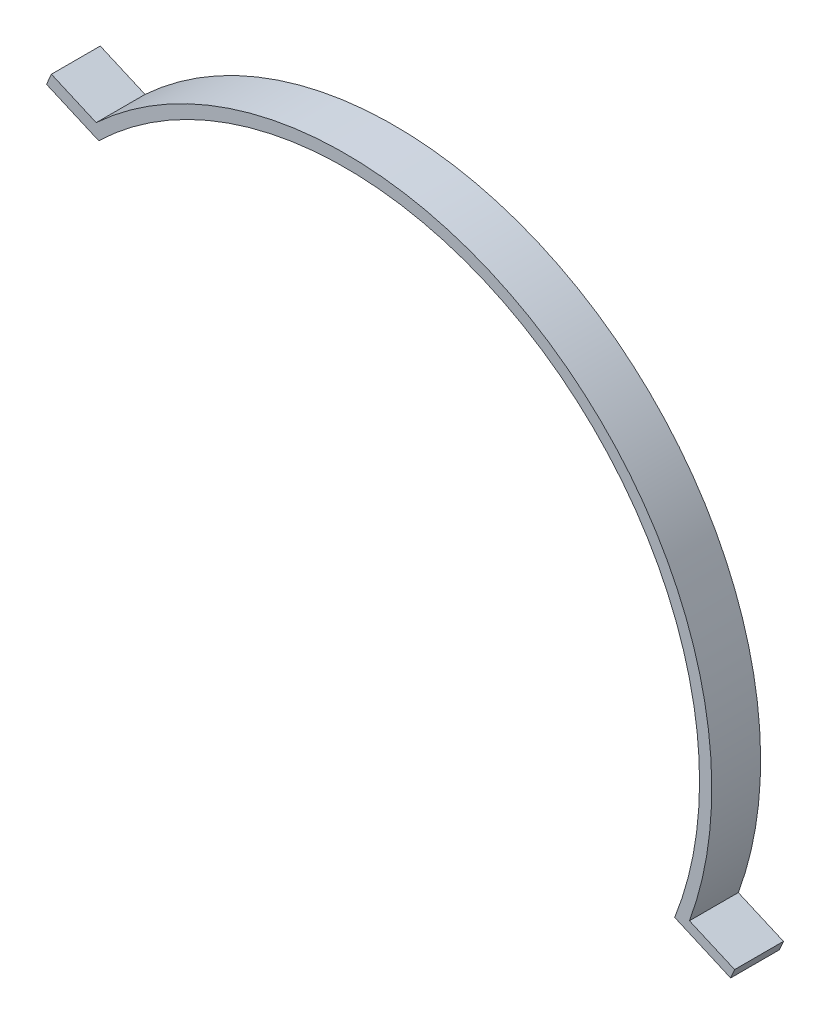
ISO-10303-21;
HEADER;
FILE_DESCRIPTION(('STEP AP214'),'2;1');
FILE_NAME('part.step','',(''),(''),'','','');
FILE_SCHEMA(('AUTOMOTIVE_DESIGN { 1 0 10303 214 1 1 1 1 }'));
ENDSEC;
DATA;
#1=APPLICATION_CONTEXT('core data for automotive mechanical design processes');
#2=APPLICATION_PROTOCOL_DEFINITION('international standard','automotive_design',2000,#1);
#3=PRODUCT_CONTEXT('',#1,'mechanical');
#4=PRODUCT('Part','Part','',(#3));
#5=PRODUCT_RELATED_PRODUCT_CATEGORY('part','',(#4));
#6=PRODUCT_DEFINITION_FORMATION('','',#4);
#7=PRODUCT_DEFINITION_CONTEXT('part definition',#1,'design');
#8=PRODUCT_DEFINITION('design','',#6,#7);
#9=PRODUCT_DEFINITION_SHAPE('','',#8);
#10=(LENGTH_UNIT() NAMED_UNIT(*) SI_UNIT(.MILLI.,.METRE.));
#11=(NAMED_UNIT(*) PLANE_ANGLE_UNIT() SI_UNIT($,.RADIAN.));
#12=(NAMED_UNIT(*) SI_UNIT($,.STERADIAN.) SOLID_ANGLE_UNIT());
#13=UNCERTAINTY_MEASURE_WITH_UNIT(LENGTH_MEASURE(1.E-05),#10,'distance_accuracy_value','');
#14=(GEOMETRIC_REPRESENTATION_CONTEXT(3) GLOBAL_UNCERTAINTY_ASSIGNED_CONTEXT((#13)) GLOBAL_UNIT_ASSIGNED_CONTEXT((#10,
#11,#12)) REPRESENTATION_CONTEXT('',''));
#15=CARTESIAN_POINT('',(0.,0.,0.));
#16=DIRECTION('',(0.,0.,1.));
#17=DIRECTION('',(1.,0.,0.));
#18=AXIS2_PLACEMENT_3D('',#15,#16,#17);
#19=CARTESIAN_POINT('',(0.,0.,20.));
#20=DIRECTION('',(0.,0.,-1.));
#21=DIRECTION('',(-1.,0.,0.));
#22=AXIS2_PLACEMENT_3D('',#19,#20,#21);
#23=CYLINDRICAL_SURFACE('',#22,150.);
#24=CARTESIAN_POINT('',(0.,0.,0.));
#25=DIRECTION('',(0.,0.,1.));
#26=DIRECTION('',(1.,0.,0.));
#27=AXIS2_PLACEMENT_3D('',#24,#25,#26);
#28=CIRCLE('',#27,150.);
#29=CARTESIAN_POINT('',(140.862056563505,-51.5546411169736,0.));
#30=VERTEX_POINT('',#29);
#31=CARTESIAN_POINT('',(-102.,109.98181667894,0.));
#32=VERTEX_POINT('',#31);
#33=EDGE_CURVE('E145',#30,#32,#28,.T.);
#34=ORIENTED_EDGE('',*,*,#33,.T.);
#35=DIRECTION('',(0.,0.,-1.));
#36=VECTOR('',#35,1.);
#37=CARTESIAN_POINT('',(-102.,109.98181667894,20.));
#38=LINE('',#37,#36);
#39=CARTESIAN_POINT('',(-102.,109.98181667894,20.));
#40=VERTEX_POINT('',#39);
#41=EDGE_CURVE('E11',#40,#32,#38,.T.);
#42=ORIENTED_EDGE('',*,*,#41,.F.);
#43=CARTESIAN_POINT('',(0.,0.,20.));
#44=DIRECTION('',(0.,0.,1.));
#45=DIRECTION('',(1.,0.,0.));
#46=AXIS2_PLACEMENT_3D('',#43,#44,#45);
#47=CIRCLE('',#46,150.);
#48=CARTESIAN_POINT('',(140.862056563505,-51.5546411169736,20.));
#49=VERTEX_POINT('',#48);
#50=EDGE_CURVE('E163',#49,#40,#47,.T.);
#51=ORIENTED_EDGE('',*,*,#50,.F.);
#52=DIRECTION('',(0.,0.,-1.));
#53=VECTOR('',#52,1.);
#54=CARTESIAN_POINT('',(140.862056563505,-51.5546411169736,20.));
#55=LINE('',#54,#53);
#56=EDGE_CURVE('E141',#49,#30,#55,.T.);
#57=ORIENTED_EDGE('',*,*,#56,.T.);
#58=EDGE_LOOP('',(#34,#42,#51,#57));
#59=FACE_BOUND('',#58,.T.);
#60=ADVANCED_FACE('F37',(#59),#23,.T.);
#61=CARTESIAN_POINT('',(-102.,109.98181667894,20.));
#62=DIRECTION('',(-0.4,-0.916515138991168,0.));
#63=DIRECTION('',(0.916515138991168,-0.400000000000001,0.));
#64=AXIS2_PLACEMENT_3D('',#61,#62,#63);
#65=PLANE('',#64);
#66=DIRECTION('',(-0.916515138991168,0.4,0.));
#67=VECTOR('',#66,1.);
#68=CARTESIAN_POINT('',(-102.,109.98181667894,0.));
#69=LINE('',#68,#67);
#70=CARTESIAN_POINT('',(-120.330302779823,117.98181667894,0.));
#71=VERTEX_POINT('',#70);
#72=EDGE_CURVE('E148',#32,#71,#69,.T.);
#73=ORIENTED_EDGE('',*,*,#72,.T.);
#74=DIRECTION('',(0.,0.,-1.));
#75=VECTOR('',#74,1.);
#76=CARTESIAN_POINT('',(-120.330302779823,117.98181667894,20.));
#77=LINE('',#76,#75);
#78=CARTESIAN_POINT('',(-120.330302779823,117.98181667894,20.));
#79=VERTEX_POINT('',#78);
#80=EDGE_CURVE('E45',#79,#71,#77,.T.);
#81=ORIENTED_EDGE('',*,*,#80,.F.);
#82=DIRECTION('',(-0.916515138991168,0.4,0.));
#83=VECTOR('',#82,1.);
#84=CARTESIAN_POINT('',(-102.,109.98181667894,20.));
#85=LINE('',#84,#83);
#86=EDGE_CURVE('E102',#40,#79,#85,.T.);
#87=ORIENTED_EDGE('',*,*,#86,.F.);
#88=ORIENTED_EDGE('',*,*,#41,.T.);
#89=EDGE_LOOP('',(#73,#81,#87,#88));
#90=FACE_BOUND('',#89,.T.);
#91=ADVANCED_FACE('F212',(#90),#65,.F.);
#92=CARTESIAN_POINT('',(-120.330302779823,117.98181667894,20.));
#93=DIRECTION('',(0.916515138991168,-0.400000000000001,0.));
#94=DIRECTION('',(0.400000000000001,0.916515138991168,0.));
#95=AXIS2_PLACEMENT_3D('',#92,#93,#94);
#96=PLANE('',#95);
#97=DIRECTION('',(-0.400000000000001,-0.916515138991168,0.));
#98=VECTOR('',#97,1.);
#99=CARTESIAN_POINT('',(-120.330302779823,117.98181667894,0.));
#100=LINE('',#99,#98);
#101=CARTESIAN_POINT('',(-122.330302779823,113.399240983984,0.));
#102=VERTEX_POINT('',#101);
#103=EDGE_CURVE('E150',#71,#102,#100,.T.);
#104=ORIENTED_EDGE('',*,*,#103,.T.);
#105=DIRECTION('',(0.,0.,-1.));
#106=VECTOR('',#105,1.);
#107=CARTESIAN_POINT('',(-122.330302779823,113.399240983984,20.));
#108=LINE('',#107,#106);
#109=CARTESIAN_POINT('',(-122.330302779823,113.399240983984,20.));
#110=VERTEX_POINT('',#109);
#111=EDGE_CURVE('E176',#110,#102,#108,.T.);
#112=ORIENTED_EDGE('',*,*,#111,.F.);
#113=DIRECTION('',(-0.400000000000001,-0.916515138991168,0.));
#114=VECTOR('',#113,1.);
#115=CARTESIAN_POINT('',(-120.330302779823,117.98181667894,20.));
#116=LINE('',#115,#114);
#117=EDGE_CURVE('E184',#79,#110,#116,.T.);
#118=ORIENTED_EDGE('',*,*,#117,.F.);
#119=ORIENTED_EDGE('',*,*,#80,.T.);
#120=EDGE_LOOP('',(#104,#112,#118,#119));
#121=FACE_BOUND('',#120,.T.);
#122=ADVANCED_FACE('F182',(#121),#96,.F.);
#123=CARTESIAN_POINT('',(-100.963409191515,104.073964104509,20.));
#124=DIRECTION('',(0.4,0.916515138991168,0.));
#125=DIRECTION('',(-0.916515138991168,0.4,0.));
#126=AXIS2_PLACEMENT_3D('',#123,#124,#125);
#127=PLANE('',#126);
#128=DIRECTION('',(0.916515138991168,-0.4,0.));
#129=VECTOR('',#128,1.);
#130=CARTESIAN_POINT('',(-100.963409191515,104.073964104509,0.));
#131=LINE('',#130,#129);
#132=CARTESIAN_POINT('',(-100.963409191515,104.073964104509,0.));
#133=VERTEX_POINT('',#132);
#134=EDGE_CURVE('E152',#102,#133,#131,.T.);
#135=ORIENTED_EDGE('',*,*,#134,.T.);
#136=DIRECTION('',(0.,0.,-1.));
#137=VECTOR('',#136,1.);
#138=CARTESIAN_POINT('',(-100.963409191515,104.073964104509,20.));
#139=LINE('',#138,#137);
#140=CARTESIAN_POINT('',(-100.963409191515,104.073964104509,20.));
#141=VERTEX_POINT('',#140);
#142=EDGE_CURVE('E173',#141,#133,#139,.T.);
#143=ORIENTED_EDGE('',*,*,#142,.F.);
#144=DIRECTION('',(0.916515138991168,-0.4,0.));
#145=VECTOR('',#144,1.);
#146=CARTESIAN_POINT('',(-100.963409191515,104.073964104509,20.));
#147=LINE('',#146,#145);
#148=EDGE_CURVE('E202',#110,#141,#147,.T.);
#149=ORIENTED_EDGE('',*,*,#148,.F.);
#150=ORIENTED_EDGE('',*,*,#111,.T.);
#151=EDGE_LOOP('',(#135,#143,#149,#150));
#152=FACE_BOUND('',#151,.T.);
#153=ADVANCED_FACE('F193',(#152),#127,.F.);
#154=CARTESIAN_POINT('',(0.,0.,20.));
#155=DIRECTION('',(0.,0.,-1.));
#156=DIRECTION('',(-1.,0.,0.));
#157=AXIS2_PLACEMENT_3D('',#154,#155,#156);
#158=CYLINDRICAL_SURFACE('',#157,145.);
#159=CARTESIAN_POINT('',(0.,0.,0.));
#160=DIRECTION('',(0.,0.,-1.));
#161=DIRECTION('',(1.,0.,0.));
#162=AXIS2_PLACEMENT_3D('',#159,#160,#161);
#163=CIRCLE('',#162,145.);
#164=CARTESIAN_POINT('',(134.815661727094,-53.3829312897451,0.));
#165=VERTEX_POINT('',#164);
#166=EDGE_CURVE('E154',#133,#165,#163,.T.);
#167=ORIENTED_EDGE('',*,*,#166,.T.);
#168=DIRECTION('',(0.,0.,-1.));
#169=VECTOR('',#168,1.);
#170=CARTESIAN_POINT('',(134.815661727094,-53.3829312897451,20.));
#171=LINE('',#170,#169);
#172=CARTESIAN_POINT('',(134.815661727094,-53.3829312897451,20.));
#173=VERTEX_POINT('',#172);
#174=EDGE_CURVE('E170',#173,#165,#171,.T.);
#175=ORIENTED_EDGE('',*,*,#174,.F.);
#176=CARTESIAN_POINT('',(0.,0.,20.));
#177=DIRECTION('',(0.,0.,-1.));
#178=DIRECTION('',(1.,0.,0.));
#179=AXIS2_PLACEMENT_3D('',#176,#177,#178);
#180=CIRCLE('',#179,145.);
#181=EDGE_CURVE('E199',#141,#173,#180,.T.);
#182=ORIENTED_EDGE('',*,*,#181,.F.);
#183=ORIENTED_EDGE('',*,*,#142,.T.);
#184=EDGE_LOOP('',(#167,#175,#182,#183));
#185=FACE_BOUND('',#184,.T.);
#186=ADVANCED_FACE('F197',(#185),#158,.F.);
#187=CARTESIAN_POINT('',(134.815661727094,-53.382931289745,20.));
#188=DIRECTION('',(0.400000000000001,0.916515138991168,0.));
#189=DIRECTION('',(-0.916515138991168,0.400000000000001,0.));
#190=AXIS2_PLACEMENT_3D('',#187,#188,#189);
#191=PLANE('',#190);
#192=DIRECTION('',(0.916515138991168,-0.400000000000001,0.));
#193=VECTOR('',#192,1.);
#194=CARTESIAN_POINT('',(134.815661727094,-53.382931289745,0.));
#195=LINE('',#194,#193);
#196=CARTESIAN_POINT('',(139.400873359692,-55.384081707247,0.));
#197=VERTEX_POINT('',#196);
#198=EDGE_CURVE('E156',#165,#197,#195,.T.);
#199=ORIENTED_EDGE('',*,*,#198,.T.);
#200=DIRECTION('',(0.,0.,-1.));
#201=VECTOR('',#200,1.);
#202=CARTESIAN_POINT('',(139.400873359692,-55.384081707247,20.));
#203=LINE('',#202,#201);
#204=CARTESIAN_POINT('',(139.400873359692,-55.384081707247,20.));
#205=VERTEX_POINT('',#204);
#206=EDGE_CURVE('E167',#205,#197,#203,.T.);
#207=ORIENTED_EDGE('',*,*,#206,.F.);
#208=DIRECTION('',(0.916515138991168,-0.400000000000001,0.));
#209=VECTOR('',#208,1.);
#210=CARTESIAN_POINT('',(134.815661727094,-53.382931289745,20.));
#211=LINE('',#210,#209);
#212=EDGE_CURVE('E201',#173,#205,#211,.T.);
#213=ORIENTED_EDGE('',*,*,#212,.F.);
#214=ORIENTED_EDGE('',*,*,#174,.T.);
#215=EDGE_LOOP('',(#199,#207,#213,#214));
#216=FACE_BOUND('',#215,.T.);
#217=ADVANCED_FACE('F224',(#216),#191,.F.);
#218=CARTESIAN_POINT('',(0.,0.,20.));
#219=DIRECTION('',(0.,0.,-1.));
#220=DIRECTION('',(-1.,0.,0.));
#221=AXIS2_PLACEMENT_3D('',#218,#219,#220);
#222=CYLINDRICAL_SURFACE('',#221,150.);
#223=CARTESIAN_POINT('',(0.,0.,0.));
#224=DIRECTION('',(0.,0.,-1.));
#225=DIRECTION('',(1.,0.,0.));
#226=AXIS2_PLACEMENT_3D('',#223,#224,#225);
#227=CIRCLE('',#226,150.);
#228=CARTESIAN_POINT('',(139.400616790022,-55.3847274847627,0.));
#229=VERTEX_POINT('',#228);
#230=EDGE_CURVE('E158',#197,#229,#227,.T.);
#231=ORIENTED_EDGE('',*,*,#230,.T.);
#232=DIRECTION('',(0.,0.,-1.));
#233=VECTOR('',#232,1.);
#234=CARTESIAN_POINT('',(139.400616790022,-55.3847274847627,20.));
#235=LINE('',#234,#233);
#236=CARTESIAN_POINT('',(139.400616790022,-55.3847274847627,20.));
#237=VERTEX_POINT('',#236);
#238=EDGE_CURVE('E136',#237,#229,#235,.T.);
#239=ORIENTED_EDGE('',*,*,#238,.F.);
#240=CARTESIAN_POINT('',(0.,0.,20.));
#241=DIRECTION('',(0.,0.,-1.));
#242=DIRECTION('',(1.,0.,0.));
#243=AXIS2_PLACEMENT_3D('',#240,#241,#242);
#244=CIRCLE('',#243,150.);
#245=EDGE_CURVE('E127',#205,#237,#244,.T.);
#246=ORIENTED_EDGE('',*,*,#245,.F.);
#247=ORIENTED_EDGE('',*,*,#206,.T.);
#248=EDGE_LOOP('',(#231,#239,#246,#247));
#249=FACE_BOUND('',#248,.T.);
#250=ADVANCED_FACE('F227',(#249),#222,.F.);
#251=CARTESIAN_POINT('',(139.400616790022,-55.3847274847626,20.));
#252=DIRECTION('',(0.401332350115997,0.915932500105969,0.));
#253=DIRECTION('',(-0.915932500105969,0.401332350115997,0.));
#254=AXIS2_PLACEMENT_3D('',#251,#252,#253);
#255=PLANE('',#254);
#256=DIRECTION('',(0.915932500105969,-0.401332350115997,0.));
#257=VECTOR('',#256,1.);
#258=CARTESIAN_POINT('',(139.400616790022,-55.3847274847626,0.));
#259=LINE('',#258,#257);
#260=CARTESIAN_POINT('',(157.719266792141,-63.4113744870826,0.));
#261=VERTEX_POINT('',#260);
#262=EDGE_CURVE('E135',#229,#261,#259,.T.);
#263=ORIENTED_EDGE('',*,*,#262,.T.);
#264=DIRECTION('',(0.,0.,-1.));
#265=VECTOR('',#264,1.);
#266=CARTESIAN_POINT('',(157.719266792141,-63.4113744870826,20.));
#267=LINE('',#266,#265);
#268=CARTESIAN_POINT('',(157.719266792141,-63.4113744870826,20.));
#269=VERTEX_POINT('',#268);
#270=EDGE_CURVE('E132',#269,#261,#267,.T.);
#271=ORIENTED_EDGE('',*,*,#270,.F.);
#272=DIRECTION('',(0.915932500105969,-0.401332350115997,0.));
#273=VECTOR('',#272,1.);
#274=CARTESIAN_POINT('',(139.400616790022,-55.3847274847626,20.));
#275=LINE('',#274,#273);
#276=EDGE_CURVE('E121',#237,#269,#275,.T.);
#277=ORIENTED_EDGE('',*,*,#276,.F.);
#278=ORIENTED_EDGE('',*,*,#238,.T.);
#279=EDGE_LOOP('',(#263,#271,#277,#278));
#280=FACE_BOUND('',#279,.T.);
#281=ADVANCED_FACE('F133',(#280),#255,.F.);
#282=CARTESIAN_POINT('',(159.355746839797,-59.6032991756311,20.));
#283=DIRECTION('',(-0.91875604945887,0.394825685059535,0.));
#284=DIRECTION('',(-0.394825685059535,-0.91875604945887,0.));
#285=AXIS2_PLACEMENT_3D('',#282,#283,#284);
#286=PLANE('',#285);
#287=DIRECTION('',(0.394825685059535,0.91875604945887,0.));
#288=VECTOR('',#287,1.);
#289=CARTESIAN_POINT('',(159.355746839797,-59.6032991756311,0.));
#290=LINE('',#289,#288);
#291=CARTESIAN_POINT('',(159.355746839797,-59.6032991756311,0.));
#292=VERTEX_POINT('',#291);
#293=EDGE_CURVE('E88',#261,#292,#290,.T.);
#294=ORIENTED_EDGE('',*,*,#293,.T.);
#295=DIRECTION('',(0.,0.,-1.));
#296=VECTOR('',#295,1.);
#297=CARTESIAN_POINT('',(159.355746839797,-59.6032991756311,20.));
#298=LINE('',#297,#296);
#299=CARTESIAN_POINT('',(159.355746839797,-59.6032991756311,20.));
#300=VERTEX_POINT('',#299);
#301=EDGE_CURVE('E137',#300,#292,#298,.T.);
#302=ORIENTED_EDGE('',*,*,#301,.F.);
#303=DIRECTION('',(0.394825685059535,0.91875604945887,0.));
#304=VECTOR('',#303,1.);
#305=CARTESIAN_POINT('',(159.355746839797,-59.6032991756311,20.));
#306=LINE('',#305,#304);
#307=EDGE_CURVE('E125',#269,#300,#306,.T.);
#308=ORIENTED_EDGE('',*,*,#307,.F.);
#309=ORIENTED_EDGE('',*,*,#270,.T.);
#310=EDGE_LOOP('',(#294,#302,#308,#309));
#311=FACE_BOUND('',#310,.T.);
#312=ADVANCED_FACE('F139',(#311),#286,.F.);
#313=CARTESIAN_POINT('',(140.862056563505,-51.5546411169736,20.));
#314=DIRECTION('',(-0.39905646581042,-0.916926353146695,0.));
#315=DIRECTION('',(0.916926353146695,-0.39905646581042,0.));
#316=AXIS2_PLACEMENT_3D('',#313,#314,#315);
#317=PLANE('',#316);
#318=DIRECTION('',(-0.916926353146695,0.39905646581042,0.));
#319=VECTOR('',#318,1.);
#320=CARTESIAN_POINT('',(140.862056563505,-51.5546411169736,0.));
#321=LINE('',#320,#319);
#322=EDGE_CURVE('E94',#292,#30,#321,.T.);
#323=ORIENTED_EDGE('',*,*,#322,.T.);
#324=ORIENTED_EDGE('',*,*,#56,.F.);
#325=DIRECTION('',(-0.916926353146695,0.39905646581042,0.));
#326=VECTOR('',#325,1.);
#327=CARTESIAN_POINT('',(140.862056563505,-51.5546411169736,20.));
#328=LINE('',#327,#326);
#329=EDGE_CURVE('E53',#300,#49,#328,.T.);
#330=ORIENTED_EDGE('',*,*,#329,.F.);
#331=ORIENTED_EDGE('',*,*,#301,.T.);
#332=EDGE_LOOP('',(#323,#324,#330,#331));
#333=FACE_BOUND('',#332,.T.);
#334=ADVANCED_FACE('F236',(#333),#317,.F.);
#335=CARTESIAN_POINT('',(0.,0.,20.));
#336=DIRECTION('',(0.,0.,1.));
#337=DIRECTION('',(1.,0.,0.));
#338=AXIS2_PLACEMENT_3D('',#335,#336,#337);
#339=PLANE('',#338);
#340=ORIENTED_EDGE('',*,*,#50,.T.);
#341=ORIENTED_EDGE('',*,*,#86,.T.);
#342=ORIENTED_EDGE('',*,*,#117,.T.);
#343=ORIENTED_EDGE('',*,*,#148,.T.);
#344=ORIENTED_EDGE('',*,*,#181,.T.);
#345=ORIENTED_EDGE('',*,*,#212,.T.);
#346=ORIENTED_EDGE('',*,*,#245,.T.);
#347=ORIENTED_EDGE('',*,*,#276,.T.);
#348=ORIENTED_EDGE('',*,*,#307,.T.);
#349=ORIENTED_EDGE('',*,*,#329,.T.);
#350=EDGE_LOOP('',(#340,#341,#342,#343,#344,#345,#346,#347,#348,#349));
#351=FACE_BOUND('',#350,.T.);
#352=ADVANCED_FACE('F123',(#351),#339,.T.);
#353=CARTESIAN_POINT('',(0.,0.,0.));
#354=DIRECTION('',(0.,0.,1.));
#355=DIRECTION('',(1.,0.,0.));
#356=AXIS2_PLACEMENT_3D('',#353,#354,#355);
#357=PLANE('',#356);
#358=ORIENTED_EDGE('',*,*,#33,.F.);
#359=ORIENTED_EDGE('',*,*,#322,.F.);
#360=ORIENTED_EDGE('',*,*,#293,.F.);
#361=ORIENTED_EDGE('',*,*,#262,.F.);
#362=ORIENTED_EDGE('',*,*,#230,.F.);
#363=ORIENTED_EDGE('',*,*,#198,.F.);
#364=ORIENTED_EDGE('',*,*,#166,.F.);
#365=ORIENTED_EDGE('',*,*,#134,.F.);
#366=ORIENTED_EDGE('',*,*,#103,.F.);
#367=ORIENTED_EDGE('',*,*,#72,.F.);
#368=EDGE_LOOP('',(#358,#359,#360,#361,#362,#363,#364,#365,#366,#367));
#369=FACE_BOUND('',#368,.T.);
#370=ADVANCED_FACE('F188',(#369),#357,.F.);
#371=CLOSED_SHELL('',(#60,#91,#122,#153,#186,#217,#250,#281,#312,#334,#352,#370));
#372=MANIFOLD_SOLID_BREP('B2',#371);
#373=ADVANCED_BREP_SHAPE_REPRESENTATION('',(#18,#372),#14);
#374=SHAPE_DEFINITION_REPRESENTATION(#9,#373);
ENDSEC;
END-ISO-10303-21;
